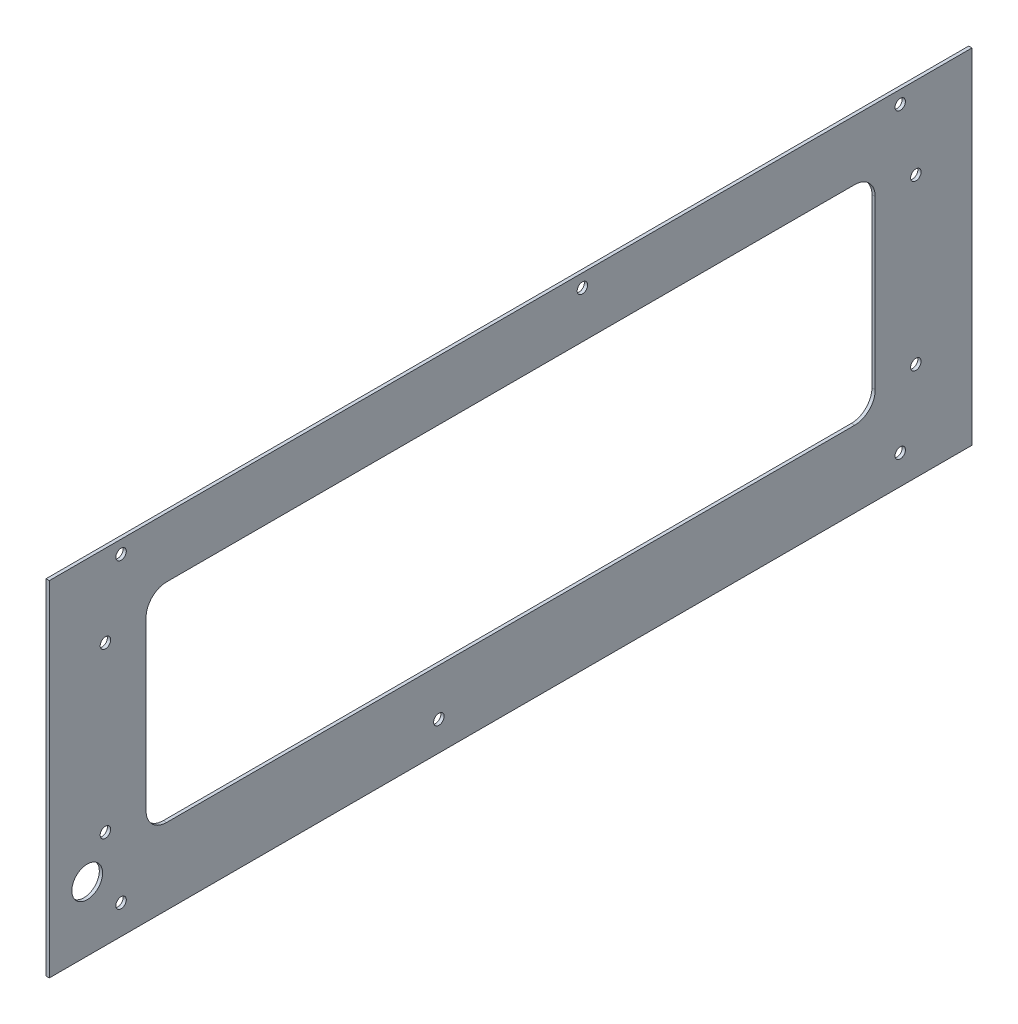
ISO-10303-21;
HEADER;
FILE_DESCRIPTION(('STEP AP214'),'2;1');
FILE_NAME('part.step','',(''),(''),'','','');
FILE_SCHEMA(('AUTOMOTIVE_DESIGN { 1 0 10303 214 1 1 1 1 }'));
ENDSEC;
DATA;
#1=APPLICATION_CONTEXT('core data for automotive mechanical design processes');
#2=APPLICATION_PROTOCOL_DEFINITION('international standard','automotive_design',2000,#1);
#3=PRODUCT_CONTEXT('',#1,'mechanical');
#4=PRODUCT('Part','Part','',(#3));
#5=PRODUCT_RELATED_PRODUCT_CATEGORY('part','',(#4));
#6=PRODUCT_DEFINITION_FORMATION('','',#4);
#7=PRODUCT_DEFINITION_CONTEXT('part definition',#1,'design');
#8=PRODUCT_DEFINITION('design','',#6,#7);
#9=PRODUCT_DEFINITION_SHAPE('','',#8);
#10=(LENGTH_UNIT() NAMED_UNIT(*) SI_UNIT(.MILLI.,.METRE.));
#11=(NAMED_UNIT(*) PLANE_ANGLE_UNIT() SI_UNIT($,.RADIAN.));
#12=(NAMED_UNIT(*) SI_UNIT($,.STERADIAN.) SOLID_ANGLE_UNIT());
#13=UNCERTAINTY_MEASURE_WITH_UNIT(LENGTH_MEASURE(1.E-05),#10,'distance_accuracy_value','');
#14=(GEOMETRIC_REPRESENTATION_CONTEXT(3) GLOBAL_UNCERTAINTY_ASSIGNED_CONTEXT((#13)) GLOBAL_UNIT_ASSIGNED_CONTEXT((#10,
#11,#12)) REPRESENTATION_CONTEXT('',''));
#15=CARTESIAN_POINT('',(0.,0.,0.));
#16=DIRECTION('',(0.,0.,1.));
#17=DIRECTION('',(1.,0.,0.));
#18=AXIS2_PLACEMENT_3D('',#15,#16,#17);
#19=CARTESIAN_POINT('',(1.6002,79.95380835,225.));
#20=DIRECTION('',(0.,0.,-1.));
#21=DIRECTION('',(0.,1.,0.));
#22=AXIS2_PLACEMENT_3D('',#19,#20,#21);
#23=PLANE('',#22);
#24=DIRECTION('',(0.,-1.,0.));
#25=VECTOR('',#24,1.);
#26=CARTESIAN_POINT('',(0.,79.95380835,225.));
#27=LINE('',#26,#25);
#28=CARTESIAN_POINT('',(0.,79.95380835,225.));
#29=VERTEX_POINT('',#28);
#30=CARTESIAN_POINT('',(0.,-87.87860835,225.));
#31=VERTEX_POINT('',#30);
#32=EDGE_CURVE('E145',#29,#31,#27,.T.);
#33=ORIENTED_EDGE('',*,*,#32,.T.);
#34=DIRECTION('',(-1.,0.,0.));
#35=VECTOR('',#34,1.);
#36=CARTESIAN_POINT('',(1.6002,-87.87860835,225.));
#37=LINE('',#36,#35);
#38=CARTESIAN_POINT('',(1.6002,-87.87860835,225.));
#39=VERTEX_POINT('',#38);
#40=EDGE_CURVE('E126',#39,#31,#37,.T.);
#41=ORIENTED_EDGE('',*,*,#40,.F.);
#42=DIRECTION('',(0.,-1.,0.));
#43=VECTOR('',#42,1.);
#44=CARTESIAN_POINT('',(1.6002,79.95380835,225.));
#45=LINE('',#44,#43);
#46=CARTESIAN_POINT('',(1.6002,79.95380835,225.));
#47=VERTEX_POINT('',#46);
#48=EDGE_CURVE('E133',#47,#39,#45,.T.);
#49=ORIENTED_EDGE('',*,*,#48,.F.);
#50=DIRECTION('',(-1.,0.,0.));
#51=VECTOR('',#50,1.);
#52=CARTESIAN_POINT('',(1.6002,79.95380835,225.));
#53=LINE('',#52,#51);
#54=EDGE_CURVE('E265',#47,#29,#53,.T.);
#55=ORIENTED_EDGE('',*,*,#54,.T.);
#56=EDGE_LOOP('',(#33,#41,#49,#55));
#57=FACE_BOUND('',#56,.T.);
#58=ADVANCED_FACE('F32',(#57),#23,.F.);
#59=CARTESIAN_POINT('',(1.6002,-87.87860835,225.));
#60=DIRECTION('',(0.,1.,0.));
#61=DIRECTION('',(0.,0.,1.));
#62=AXIS2_PLACEMENT_3D('',#59,#60,#61);
#63=PLANE('',#62);
#64=DIRECTION('',(0.,0.,-1.));
#65=VECTOR('',#64,1.);
#66=CARTESIAN_POINT('',(0.,-87.87860835,225.));
#67=LINE('',#66,#65);
#68=CARTESIAN_POINT('',(0.,-87.87860835,-225.));
#69=VERTEX_POINT('',#68);
#70=EDGE_CURVE('E267',#31,#69,#67,.T.);
#71=ORIENTED_EDGE('',*,*,#70,.T.);
#72=DIRECTION('',(-1.,0.,0.));
#73=VECTOR('',#72,1.);
#74=CARTESIAN_POINT('',(1.6002,-87.87860835,-225.));
#75=LINE('',#74,#73);
#76=CARTESIAN_POINT('',(1.6002,-87.87860835,-225.));
#77=VERTEX_POINT('',#76);
#78=EDGE_CURVE('E129',#77,#69,#75,.T.);
#79=ORIENTED_EDGE('',*,*,#78,.F.);
#80=DIRECTION('',(0.,0.,-1.));
#81=VECTOR('',#80,1.);
#82=CARTESIAN_POINT('',(1.6002,-87.87860835,225.));
#83=LINE('',#82,#81);
#84=EDGE_CURVE('E122',#39,#77,#83,.T.);
#85=ORIENTED_EDGE('',*,*,#84,.F.);
#86=ORIENTED_EDGE('',*,*,#40,.T.);
#87=EDGE_LOOP('',(#71,#79,#85,#86));
#88=FACE_BOUND('',#87,.T.);
#89=ADVANCED_FACE('F124',(#88),#63,.F.);
#90=CARTESIAN_POINT('',(1.6002,79.95380835,-225.));
#91=DIRECTION('',(0.,0.,1.));
#92=DIRECTION('',(0.,-1.,0.));
#93=AXIS2_PLACEMENT_3D('',#90,#91,#92);
#94=PLANE('',#93);
#95=DIRECTION('',(0.,1.,0.));
#96=VECTOR('',#95,1.);
#97=CARTESIAN_POINT('',(0.,79.95380835,-225.));
#98=LINE('',#97,#96);
#99=CARTESIAN_POINT('',(0.,79.95380835,-225.));
#100=VERTEX_POINT('',#99);
#101=EDGE_CURVE('E269',#69,#100,#98,.T.);
#102=ORIENTED_EDGE('',*,*,#101,.T.);
#103=DIRECTION('',(-1.,0.,0.));
#104=VECTOR('',#103,1.);
#105=CARTESIAN_POINT('',(1.6002,79.95380835,-225.));
#106=LINE('',#105,#104);
#107=CARTESIAN_POINT('',(1.6002,79.95380835,-225.));
#108=VERTEX_POINT('',#107);
#109=EDGE_CURVE('E150',#108,#100,#106,.T.);
#110=ORIENTED_EDGE('',*,*,#109,.F.);
#111=DIRECTION('',(0.,1.,0.));
#112=VECTOR('',#111,1.);
#113=CARTESIAN_POINT('',(1.6002,79.95380835,-225.));
#114=LINE('',#113,#112);
#115=EDGE_CURVE('E132',#77,#108,#114,.T.);
#116=ORIENTED_EDGE('',*,*,#115,.F.);
#117=ORIENTED_EDGE('',*,*,#78,.T.);
#118=EDGE_LOOP('',(#102,#110,#116,#117));
#119=FACE_BOUND('',#118,.T.);
#120=ADVANCED_FACE('F280',(#119),#94,.F.);
#121=CARTESIAN_POINT('',(1.6002,79.95380835,225.));
#122=DIRECTION('',(0.,-1.,0.));
#123=DIRECTION('',(0.,0.,-1.));
#124=AXIS2_PLACEMENT_3D('',#121,#122,#123);
#125=PLANE('',#124);
#126=DIRECTION('',(0.,0.,1.));
#127=VECTOR('',#126,1.);
#128=CARTESIAN_POINT('',(0.,79.95380835,225.));
#129=LINE('',#128,#127);
#130=EDGE_CURVE('E142',#100,#29,#129,.T.);
#131=ORIENTED_EDGE('',*,*,#130,.T.);
#132=ORIENTED_EDGE('',*,*,#54,.F.);
#133=DIRECTION('',(0.,0.,1.));
#134=VECTOR('',#133,1.);
#135=CARTESIAN_POINT('',(1.6002,79.95380835,225.));
#136=LINE('',#135,#134);
#137=EDGE_CURVE('E138',#108,#47,#136,.T.);
#138=ORIENTED_EDGE('',*,*,#137,.F.);
#139=ORIENTED_EDGE('',*,*,#109,.T.);
#140=EDGE_LOOP('',(#131,#132,#138,#139));
#141=FACE_BOUND('',#140,.T.);
#142=ADVANCED_FACE('F276',(#141),#125,.F.);
#143=CARTESIAN_POINT('',(1.6002,0.,0.));
#144=DIRECTION('',(1.,0.,0.));
#145=DIRECTION('',(0.,0.,-1.));
#146=AXIS2_PLACEMENT_3D('',#143,#144,#145);
#147=PLANE('',#146);
#148=CARTESIAN_POINT('',(1.6002,40.,197.627));
#149=DIRECTION('',(1.,0.,0.));
#150=DIRECTION('',(0.,0.,-1.));
#151=AXIS2_PLACEMENT_3D('',#148,#149,#150);
#152=CIRCLE('',#151,2.55269999999998);
#153=CARTESIAN_POINT('',(1.6002,40.,195.0743));
#154=VERTEX_POINT('',#153);
#155=EDGE_CURVE('E395',#154,#154,#152,.T.);
#156=ORIENTED_EDGE('',*,*,#155,.F.);
#157=EDGE_LOOP('',(#156));
#158=FACE_BOUND('',#157,.T.);
#159=CARTESIAN_POINT('',(1.6002,-40.,197.627));
#160=DIRECTION('',(1.,0.,0.));
#161=DIRECTION('',(0.,0.,-1.));
#162=AXIS2_PLACEMENT_3D('',#159,#160,#161);
#163=CIRCLE('',#162,2.55269999999998);
#164=CARTESIAN_POINT('',(1.6002,-40.,195.0743));
#165=VERTEX_POINT('',#164);
#166=EDGE_CURVE('E391',#165,#165,#163,.T.);
#167=ORIENTED_EDGE('',*,*,#166,.F.);
#168=EDGE_LOOP('',(#167));
#169=FACE_BOUND('',#168,.T.);
#170=CARTESIAN_POINT('',(1.6002,-40.,-197.627));
#171=DIRECTION('',(1.,0.,0.));
#172=DIRECTION('',(0.,0.,-1.));
#173=AXIS2_PLACEMENT_3D('',#170,#171,#172);
#174=CIRCLE('',#173,2.55269999999998);
#175=CARTESIAN_POINT('',(1.6002,-40.,-200.1797));
#176=VERTEX_POINT('',#175);
#177=EDGE_CURVE('E385',#176,#176,#174,.T.);
#178=ORIENTED_EDGE('',*,*,#177,.F.);
#179=EDGE_LOOP('',(#178));
#180=FACE_BOUND('',#179,.T.);
#181=CARTESIAN_POINT('',(1.6002,40.,-197.627));
#182=DIRECTION('',(1.,0.,0.));
#183=DIRECTION('',(0.,0.,-1.));
#184=AXIS2_PLACEMENT_3D('',#181,#182,#183);
#185=CIRCLE('',#184,2.55269999999998);
#186=CARTESIAN_POINT('',(1.6002,40.,-200.1797));
#187=VERTEX_POINT('',#186);
#188=EDGE_CURVE('E381',#187,#187,#185,.T.);
#189=ORIENTED_EDGE('',*,*,#188,.F.);
#190=EDGE_LOOP('',(#189));
#191=FACE_BOUND('',#190,.T.);
#192=DIRECTION('',(0.,-1.,0.));
#193=VECTOR('',#192,1.);
#194=CARTESIAN_POINT('',(1.6002,50.8,177.8));
#195=LINE('',#194,#193);
#196=CARTESIAN_POINT('',(1.6002,40.8,177.8));
#197=VERTEX_POINT('',#196);
#198=CARTESIAN_POINT('',(1.6002,-40.8,177.8));
#199=VERTEX_POINT('',#198);
#200=EDGE_CURVE('E207',#197,#199,#195,.T.);
#201=ORIENTED_EDGE('',*,*,#200,.F.);
#202=CARTESIAN_POINT('',(1.6002,40.8,167.8));
#203=DIRECTION('',(1.,0.,0.));
#204=DIRECTION('',(0.,0.,-1.));
#205=AXIS2_PLACEMENT_3D('',#202,#203,#204);
#206=CIRCLE('',#205,10.);
#207=CARTESIAN_POINT('',(1.6002,50.8,167.8));
#208=VERTEX_POINT('',#207);
#209=EDGE_CURVE('E40',#197,#208,#206,.F.);
#210=ORIENTED_EDGE('',*,*,#209,.T.);
#211=DIRECTION('',(0.,0.,1.));
#212=VECTOR('',#211,1.);
#213=CARTESIAN_POINT('',(1.6002,50.8,177.8));
#214=LINE('',#213,#212);
#215=CARTESIAN_POINT('',(1.6002,50.8,-167.8));
#216=VERTEX_POINT('',#215);
#217=EDGE_CURVE('E205',#216,#208,#214,.T.);
#218=ORIENTED_EDGE('',*,*,#217,.F.);
#219=CARTESIAN_POINT('',(1.6002,40.8,-167.8));
#220=DIRECTION('',(1.,0.,0.));
#221=DIRECTION('',(0.,0.,-1.));
#222=AXIS2_PLACEMENT_3D('',#219,#220,#221);
#223=CIRCLE('',#222,10.);
#224=CARTESIAN_POINT('',(1.6002,40.8,-177.8));
#225=VERTEX_POINT('',#224);
#226=EDGE_CURVE('E199',#216,#225,#223,.F.);
#227=ORIENTED_EDGE('',*,*,#226,.T.);
#228=DIRECTION('',(0.,1.,0.));
#229=VECTOR('',#228,1.);
#230=CARTESIAN_POINT('',(1.6002,50.8,-177.8));
#231=LINE('',#230,#229);
#232=CARTESIAN_POINT('',(1.6002,-40.8,-177.8));
#233=VERTEX_POINT('',#232);
#234=EDGE_CURVE('E213',#233,#225,#231,.T.);
#235=ORIENTED_EDGE('',*,*,#234,.F.);
#236=CARTESIAN_POINT('',(1.6002,-40.8,-167.8));
#237=DIRECTION('',(1.,0.,0.));
#238=DIRECTION('',(0.,0.,-1.));
#239=AXIS2_PLACEMENT_3D('',#236,#237,#238);
#240=CIRCLE('',#239,10.);
#241=CARTESIAN_POINT('',(1.6002,-50.8,-167.8));
#242=VERTEX_POINT('',#241);
#243=EDGE_CURVE('E195',#233,#242,#240,.F.);
#244=ORIENTED_EDGE('',*,*,#243,.T.);
#245=DIRECTION('',(0.,0.,-1.));
#246=VECTOR('',#245,1.);
#247=CARTESIAN_POINT('',(1.6002,-50.8,177.8));
#248=LINE('',#247,#246);
#249=CARTESIAN_POINT('',(1.6002,-50.8,167.8));
#250=VERTEX_POINT('',#249);
#251=EDGE_CURVE('E238',#250,#242,#248,.T.);
#252=ORIENTED_EDGE('',*,*,#251,.F.);
#253=CARTESIAN_POINT('',(1.6002,-40.8,167.8));
#254=DIRECTION('',(1.,0.,0.));
#255=DIRECTION('',(0.,0.,-1.));
#256=AXIS2_PLACEMENT_3D('',#253,#254,#255);
#257=CIRCLE('',#256,10.);
#258=EDGE_CURVE('E191',#250,#199,#257,.F.);
#259=ORIENTED_EDGE('',*,*,#258,.T.);
#260=EDGE_LOOP('',(#201,#210,#218,#227,#235,#244,#252,#259));
#261=FACE_BOUND('',#260,.T.);
#262=CARTESIAN_POINT('',(1.6002,-56.5321,206.5));
#263=DIRECTION('',(1.,0.,0.));
#264=DIRECTION('',(0.,0.,-1.));
#265=AXIS2_PLACEMENT_3D('',#262,#263,#264);
#266=CIRCLE('',#265,7.50000000000001);
#267=CARTESIAN_POINT('',(1.6002,-56.5321,199.));
#268=VERTEX_POINT('',#267);
#269=EDGE_CURVE('E236',#268,#268,#266,.T.);
#270=ORIENTED_EDGE('',*,*,#269,.F.);
#271=EDGE_LOOP('',(#270));
#272=FACE_BOUND('',#271,.T.);
#273=CARTESIAN_POINT('',(1.6002,73.59110835,190.));
#274=DIRECTION('',(1.,0.,0.));
#275=DIRECTION('',(0.,0.,-1.));
#276=AXIS2_PLACEMENT_3D('',#273,#274,#275);
#277=CIRCLE('',#276,2.55269999999999);
#278=CARTESIAN_POINT('',(1.6002,73.59110835,187.4473));
#279=VERTEX_POINT('',#278);
#280=EDGE_CURVE('E173',#279,#279,#277,.T.);
#281=ORIENTED_EDGE('',*,*,#280,.F.);
#282=EDGE_LOOP('',(#281));
#283=FACE_BOUND('',#282,.T.);
#284=CARTESIAN_POINT('',(1.6002,73.59110835,-35.));
#285=DIRECTION('',(1.,0.,0.));
#286=DIRECTION('',(0.,0.,-1.));
#287=AXIS2_PLACEMENT_3D('',#284,#285,#286);
#288=CIRCLE('',#287,2.55269999999999);
#289=CARTESIAN_POINT('',(1.6002,73.59110835,-37.5527));
#290=VERTEX_POINT('',#289);
#291=EDGE_CURVE('E170',#290,#290,#288,.T.);
#292=ORIENTED_EDGE('',*,*,#291,.F.);
#293=EDGE_LOOP('',(#292));
#294=FACE_BOUND('',#293,.T.);
#295=CARTESIAN_POINT('',(1.6002,-73.59110835,35.));
#296=DIRECTION('',(1.,0.,0.));
#297=DIRECTION('',(0.,0.,-1.));
#298=AXIS2_PLACEMENT_3D('',#295,#296,#297);
#299=CIRCLE('',#298,2.55269999999999);
#300=CARTESIAN_POINT('',(1.6002,-73.59110835,32.4473));
#301=VERTEX_POINT('',#300);
#302=EDGE_CURVE('E166',#301,#301,#299,.T.);
#303=ORIENTED_EDGE('',*,*,#302,.F.);
#304=EDGE_LOOP('',(#303));
#305=FACE_BOUND('',#304,.T.);
#306=CARTESIAN_POINT('',(1.6002,-73.59110835,190.));
#307=DIRECTION('',(1.,0.,0.));
#308=DIRECTION('',(0.,0.,-1.));
#309=AXIS2_PLACEMENT_3D('',#306,#307,#308);
#310=CIRCLE('',#309,2.55269999999999);
#311=CARTESIAN_POINT('',(1.6002,-73.59110835,187.4473));
#312=VERTEX_POINT('',#311);
#313=EDGE_CURVE('E162',#312,#312,#310,.T.);
#314=ORIENTED_EDGE('',*,*,#313,.F.);
#315=EDGE_LOOP('',(#314));
#316=FACE_BOUND('',#315,.T.);
#317=CARTESIAN_POINT('',(1.6002,73.59110835,-190.));
#318=DIRECTION('',(1.,0.,0.));
#319=DIRECTION('',(0.,0.,-1.));
#320=AXIS2_PLACEMENT_3D('',#317,#318,#319);
#321=CIRCLE('',#320,2.55269999999999);
#322=CARTESIAN_POINT('',(1.6002,73.59110835,-192.5527));
#323=VERTEX_POINT('',#322);
#324=EDGE_CURVE('E158',#323,#323,#321,.T.);
#325=ORIENTED_EDGE('',*,*,#324,.F.);
#326=EDGE_LOOP('',(#325));
#327=FACE_BOUND('',#326,.T.);
#328=CARTESIAN_POINT('',(1.6002,-73.59110835,-190.));
#329=DIRECTION('',(1.,0.,0.));
#330=DIRECTION('',(0.,0.,-1.));
#331=AXIS2_PLACEMENT_3D('',#328,#329,#330);
#332=CIRCLE('',#331,2.55269999999999);
#333=CARTESIAN_POINT('',(1.6002,-73.59110835,-192.5527));
#334=VERTEX_POINT('',#333);
#335=EDGE_CURVE('E157',#334,#334,#332,.T.);
#336=ORIENTED_EDGE('',*,*,#335,.F.);
#337=EDGE_LOOP('',(#336));
#338=FACE_BOUND('',#337,.T.);
#339=ORIENTED_EDGE('',*,*,#48,.T.);
#340=ORIENTED_EDGE('',*,*,#84,.T.);
#341=ORIENTED_EDGE('',*,*,#115,.T.);
#342=ORIENTED_EDGE('',*,*,#137,.T.);
#343=EDGE_LOOP('',(#339,#340,#341,#342));
#344=FACE_BOUND('',#343,.T.);
#345=ADVANCED_FACE('F136',(#158,#169,#180,#191,#261,#272,#283,#294,#305,#316,#327,#338,#344),
#147,.T.);
#346=CARTESIAN_POINT('',(0.,0.,0.));
#347=DIRECTION('',(1.,0.,0.));
#348=DIRECTION('',(0.,0.,-1.));
#349=AXIS2_PLACEMENT_3D('',#346,#347,#348);
#350=PLANE('',#349);
#351=CARTESIAN_POINT('',(0.,40.,197.627));
#352=DIRECTION('',(1.,0.,0.));
#353=DIRECTION('',(0.,0.,-1.));
#354=AXIS2_PLACEMENT_3D('',#351,#352,#353);
#355=CIRCLE('',#354,2.5527);
#356=CARTESIAN_POINT('',(0.,40.,195.0743));
#357=VERTEX_POINT('',#356);
#358=EDGE_CURVE('E369',#357,#357,#355,.T.);
#359=ORIENTED_EDGE('',*,*,#358,.T.);
#360=EDGE_LOOP('',(#359));
#361=FACE_BOUND('',#360,.T.);
#362=CARTESIAN_POINT('',(0.,-40.,197.627));
#363=DIRECTION('',(1.,0.,0.));
#364=DIRECTION('',(0.,0.,-1.));
#365=AXIS2_PLACEMENT_3D('',#362,#363,#364);
#366=CIRCLE('',#365,2.5527);
#367=CARTESIAN_POINT('',(0.,-40.,195.0743));
#368=VERTEX_POINT('',#367);
#369=EDGE_CURVE('E373',#368,#368,#366,.T.);
#370=ORIENTED_EDGE('',*,*,#369,.T.);
#371=EDGE_LOOP('',(#370));
#372=FACE_BOUND('',#371,.T.);
#373=CARTESIAN_POINT('',(0.,-40.,-197.627));
#374=DIRECTION('',(1.,0.,0.));
#375=DIRECTION('',(0.,0.,-1.));
#376=AXIS2_PLACEMENT_3D('',#373,#374,#375);
#377=CIRCLE('',#376,2.5527);
#378=CARTESIAN_POINT('',(0.,-40.,-200.1797));
#379=VERTEX_POINT('',#378);
#380=EDGE_CURVE('E377',#379,#379,#377,.T.);
#381=ORIENTED_EDGE('',*,*,#380,.T.);
#382=EDGE_LOOP('',(#381));
#383=FACE_BOUND('',#382,.T.);
#384=CARTESIAN_POINT('',(0.,40.,-197.627));
#385=DIRECTION('',(1.,0.,0.));
#386=DIRECTION('',(0.,0.,-1.));
#387=AXIS2_PLACEMENT_3D('',#384,#385,#386);
#388=CIRCLE('',#387,2.5527);
#389=CARTESIAN_POINT('',(0.,40.,-200.1797));
#390=VERTEX_POINT('',#389);
#391=EDGE_CURVE('E231',#390,#390,#388,.T.);
#392=ORIENTED_EDGE('',*,*,#391,.T.);
#393=EDGE_LOOP('',(#392));
#394=FACE_BOUND('',#393,.T.);
#395=DIRECTION('',(0.,1.,0.));
#396=VECTOR('',#395,1.);
#397=CARTESIAN_POINT('',(0.,50.8,-177.8));
#398=LINE('',#397,#396);
#399=CARTESIAN_POINT('',(0.,-40.8,-177.8));
#400=VERTEX_POINT('',#399);
#401=CARTESIAN_POINT('',(0.,40.8,-177.8));
#402=VERTEX_POINT('',#401);
#403=EDGE_CURVE('E228',#400,#402,#398,.T.);
#404=ORIENTED_EDGE('',*,*,#403,.T.);
#405=CARTESIAN_POINT('',(0.,40.8,-167.8));
#406=DIRECTION('',(1.,0.,0.));
#407=DIRECTION('',(0.,0.,-1.));
#408=AXIS2_PLACEMENT_3D('',#405,#406,#407);
#409=CIRCLE('',#408,10.);
#410=CARTESIAN_POINT('',(0.,50.8,-167.8));
#411=VERTEX_POINT('',#410);
#412=EDGE_CURVE('E54',#402,#411,#409,.T.);
#413=ORIENTED_EDGE('',*,*,#412,.T.);
#414=DIRECTION('',(0.,0.,1.));
#415=VECTOR('',#414,1.);
#416=CARTESIAN_POINT('',(0.,50.8,177.8));
#417=LINE('',#416,#415);
#418=CARTESIAN_POINT('',(0.,50.8,167.8));
#419=VERTEX_POINT('',#418);
#420=EDGE_CURVE('E221',#411,#419,#417,.T.);
#421=ORIENTED_EDGE('',*,*,#420,.T.);
#422=CARTESIAN_POINT('',(0.,40.8,167.8));
#423=DIRECTION('',(1.,0.,0.));
#424=DIRECTION('',(0.,0.,-1.));
#425=AXIS2_PLACEMENT_3D('',#422,#423,#424);
#426=CIRCLE('',#425,10.);
#427=CARTESIAN_POINT('',(0.,40.8,177.8));
#428=VERTEX_POINT('',#427);
#429=EDGE_CURVE('E11',#419,#428,#426,.T.);
#430=ORIENTED_EDGE('',*,*,#429,.T.);
#431=DIRECTION('',(0.,-1.,0.));
#432=VECTOR('',#431,1.);
#433=CARTESIAN_POINT('',(0.,50.8,177.8));
#434=LINE('',#433,#432);
#435=CARTESIAN_POINT('',(0.,-40.8,177.8));
#436=VERTEX_POINT('',#435);
#437=EDGE_CURVE('E212',#428,#436,#434,.T.);
#438=ORIENTED_EDGE('',*,*,#437,.T.);
#439=CARTESIAN_POINT('',(0.,-40.8,167.8));
#440=DIRECTION('',(1.,0.,0.));
#441=DIRECTION('',(0.,0.,-1.));
#442=AXIS2_PLACEMENT_3D('',#439,#440,#441);
#443=CIRCLE('',#442,10.);
#444=CARTESIAN_POINT('',(0.,-50.8,167.8));
#445=VERTEX_POINT('',#444);
#446=EDGE_CURVE('E193',#436,#445,#443,.T.);
#447=ORIENTED_EDGE('',*,*,#446,.T.);
#448=DIRECTION('',(0.,0.,-1.));
#449=VECTOR('',#448,1.);
#450=CARTESIAN_POINT('',(0.,-50.8,177.8));
#451=LINE('',#450,#449);
#452=CARTESIAN_POINT('',(0.,-50.8,-167.8));
#453=VERTEX_POINT('',#452);
#454=EDGE_CURVE('E225',#445,#453,#451,.T.);
#455=ORIENTED_EDGE('',*,*,#454,.T.);
#456=CARTESIAN_POINT('',(0.,-40.8,-167.8));
#457=DIRECTION('',(1.,0.,0.));
#458=DIRECTION('',(0.,0.,-1.));
#459=AXIS2_PLACEMENT_3D('',#456,#457,#458);
#460=CIRCLE('',#459,10.);
#461=EDGE_CURVE('E197',#453,#400,#460,.T.);
#462=ORIENTED_EDGE('',*,*,#461,.T.);
#463=EDGE_LOOP('',(#404,#413,#421,#430,#438,#447,#455,#462));
#464=FACE_BOUND('',#463,.T.);
#465=CARTESIAN_POINT('',(0.,-56.5321,206.5));
#466=DIRECTION('',(1.,0.,0.));
#467=DIRECTION('',(0.,0.,-1.));
#468=AXIS2_PLACEMENT_3D('',#465,#466,#467);
#469=CIRCLE('',#468,7.50000000000001);
#470=CARTESIAN_POINT('',(0.,-56.5321,199.));
#471=VERTEX_POINT('',#470);
#472=EDGE_CURVE('E243',#471,#471,#469,.T.);
#473=ORIENTED_EDGE('',*,*,#472,.T.);
#474=EDGE_LOOP('',(#473));
#475=FACE_BOUND('',#474,.T.);
#476=CARTESIAN_POINT('',(0.,73.59110835,190.));
#477=DIRECTION('',(1.,0.,0.));
#478=DIRECTION('',(0.,0.,-1.));
#479=AXIS2_PLACEMENT_3D('',#476,#477,#478);
#480=CIRCLE('',#479,2.55269999999998);
#481=CARTESIAN_POINT('',(0.,73.59110835,187.4473));
#482=VERTEX_POINT('',#481);
#483=EDGE_CURVE('E171',#482,#482,#480,.T.);
#484=ORIENTED_EDGE('',*,*,#483,.T.);
#485=EDGE_LOOP('',(#484));
#486=FACE_BOUND('',#485,.T.);
#487=CARTESIAN_POINT('',(0.,73.59110835,-35.));
#488=DIRECTION('',(1.,0.,0.));
#489=DIRECTION('',(0.,0.,-1.));
#490=AXIS2_PLACEMENT_3D('',#487,#488,#489);
#491=CIRCLE('',#490,2.55269999999998);
#492=CARTESIAN_POINT('',(0.,73.59110835,-37.5526999999999));
#493=VERTEX_POINT('',#492);
#494=EDGE_CURVE('E167',#493,#493,#491,.T.);
#495=ORIENTED_EDGE('',*,*,#494,.T.);
#496=EDGE_LOOP('',(#495));
#497=FACE_BOUND('',#496,.T.);
#498=CARTESIAN_POINT('',(0.,-73.59110835,35.));
#499=DIRECTION('',(1.,0.,0.));
#500=DIRECTION('',(0.,0.,-1.));
#501=AXIS2_PLACEMENT_3D('',#498,#499,#500);
#502=CIRCLE('',#501,2.55269999999998);
#503=CARTESIAN_POINT('',(0.,-73.59110835,32.4473));
#504=VERTEX_POINT('',#503);
#505=EDGE_CURVE('E163',#504,#504,#502,.T.);
#506=ORIENTED_EDGE('',*,*,#505,.T.);
#507=EDGE_LOOP('',(#506));
#508=FACE_BOUND('',#507,.T.);
#509=CARTESIAN_POINT('',(0.,-73.59110835,190.));
#510=DIRECTION('',(1.,0.,0.));
#511=DIRECTION('',(0.,0.,-1.));
#512=AXIS2_PLACEMENT_3D('',#509,#510,#511);
#513=CIRCLE('',#512,2.55269999999998);
#514=CARTESIAN_POINT('',(0.,-73.59110835,187.4473));
#515=VERTEX_POINT('',#514);
#516=EDGE_CURVE('E159',#515,#515,#513,.T.);
#517=ORIENTED_EDGE('',*,*,#516,.T.);
#518=EDGE_LOOP('',(#517));
#519=FACE_BOUND('',#518,.T.);
#520=CARTESIAN_POINT('',(0.,73.59110835,-190.));
#521=DIRECTION('',(1.,0.,0.));
#522=DIRECTION('',(0.,0.,-1.));
#523=AXIS2_PLACEMENT_3D('',#520,#521,#522);
#524=CIRCLE('',#523,2.55269999999998);
#525=CARTESIAN_POINT('',(0.,73.59110835,-192.5527));
#526=VERTEX_POINT('',#525);
#527=EDGE_CURVE('E154',#526,#526,#524,.T.);
#528=ORIENTED_EDGE('',*,*,#527,.T.);
#529=EDGE_LOOP('',(#528));
#530=FACE_BOUND('',#529,.T.);
#531=CARTESIAN_POINT('',(0.,-73.59110835,-190.));
#532=DIRECTION('',(1.,0.,0.));
#533=DIRECTION('',(0.,0.,-1.));
#534=AXIS2_PLACEMENT_3D('',#531,#532,#533);
#535=CIRCLE('',#534,2.55269999999998);
#536=CARTESIAN_POINT('',(0.,-73.59110835,-192.5527));
#537=VERTEX_POINT('',#536);
#538=EDGE_CURVE('E260',#537,#537,#535,.T.);
#539=ORIENTED_EDGE('',*,*,#538,.T.);
#540=EDGE_LOOP('',(#539));
#541=FACE_BOUND('',#540,.T.);
#542=ORIENTED_EDGE('',*,*,#32,.F.);
#543=ORIENTED_EDGE('',*,*,#130,.F.);
#544=ORIENTED_EDGE('',*,*,#101,.F.);
#545=ORIENTED_EDGE('',*,*,#70,.F.);
#546=EDGE_LOOP('',(#542,#543,#544,#545));
#547=FACE_BOUND('',#546,.T.);
#548=ADVANCED_FACE('F218',(#361,#372,#383,#394,#464,#475,#486,#497,#508,#519,#530,#541,#547),
#350,.F.);
#549=CARTESIAN_POINT('',(1.6002,-73.59110835,-190.));
#550=DIRECTION('',(1.,0.,0.));
#551=DIRECTION('',(0.,0.,-1.));
#552=AXIS2_PLACEMENT_3D('',#549,#550,#551);
#553=CYLINDRICAL_SURFACE('',#552,2.55269999999998);
#554=ORIENTED_EDGE('',*,*,#335,.T.);
#555=EDGE_LOOP('',(#554));
#556=FACE_BOUND('',#555,.T.);
#557=ORIENTED_EDGE('',*,*,#538,.F.);
#558=EDGE_LOOP('',(#557));
#559=FACE_BOUND('',#558,.T.);
#560=ADVANCED_FACE('F354',(#556,#559),#553,.F.);
#561=CARTESIAN_POINT('',(1.6002,73.59110835,-190.));
#562=DIRECTION('',(1.,0.,0.));
#563=DIRECTION('',(0.,0.,-1.));
#564=AXIS2_PLACEMENT_3D('',#561,#562,#563);
#565=CYLINDRICAL_SURFACE('',#564,2.55269999999998);
#566=ORIENTED_EDGE('',*,*,#324,.T.);
#567=EDGE_LOOP('',(#566));
#568=FACE_BOUND('',#567,.T.);
#569=ORIENTED_EDGE('',*,*,#527,.F.);
#570=EDGE_LOOP('',(#569));
#571=FACE_BOUND('',#570,.T.);
#572=ADVANCED_FACE('F350',(#568,#571),#565,.F.);
#573=CARTESIAN_POINT('',(1.6002,-73.59110835,190.));
#574=DIRECTION('',(1.,0.,0.));
#575=DIRECTION('',(0.,0.,-1.));
#576=AXIS2_PLACEMENT_3D('',#573,#574,#575);
#577=CYLINDRICAL_SURFACE('',#576,2.55269999999998);
#578=ORIENTED_EDGE('',*,*,#313,.T.);
#579=EDGE_LOOP('',(#578));
#580=FACE_BOUND('',#579,.T.);
#581=ORIENTED_EDGE('',*,*,#516,.F.);
#582=EDGE_LOOP('',(#581));
#583=FACE_BOUND('',#582,.T.);
#584=ADVANCED_FACE('F346',(#580,#583),#577,.F.);
#585=CARTESIAN_POINT('',(1.6002,-73.59110835,35.));
#586=DIRECTION('',(1.,0.,0.));
#587=DIRECTION('',(0.,0.,-1.));
#588=AXIS2_PLACEMENT_3D('',#585,#586,#587);
#589=CYLINDRICAL_SURFACE('',#588,2.55269999999998);
#590=ORIENTED_EDGE('',*,*,#302,.T.);
#591=EDGE_LOOP('',(#590));
#592=FACE_BOUND('',#591,.T.);
#593=ORIENTED_EDGE('',*,*,#505,.F.);
#594=EDGE_LOOP('',(#593));
#595=FACE_BOUND('',#594,.T.);
#596=ADVANCED_FACE('F342',(#592,#595),#589,.F.);
#597=CARTESIAN_POINT('',(1.6002,73.59110835,-35.));
#598=DIRECTION('',(1.,0.,0.));
#599=DIRECTION('',(0.,0.,-1.));
#600=AXIS2_PLACEMENT_3D('',#597,#598,#599);
#601=CYLINDRICAL_SURFACE('',#600,2.55269999999998);
#602=ORIENTED_EDGE('',*,*,#291,.T.);
#603=EDGE_LOOP('',(#602));
#604=FACE_BOUND('',#603,.T.);
#605=ORIENTED_EDGE('',*,*,#494,.F.);
#606=EDGE_LOOP('',(#605));
#607=FACE_BOUND('',#606,.T.);
#608=ADVANCED_FACE('F338',(#604,#607),#601,.F.);
#609=CARTESIAN_POINT('',(1.6002,73.59110835,190.));
#610=DIRECTION('',(1.,0.,0.));
#611=DIRECTION('',(0.,0.,-1.));
#612=AXIS2_PLACEMENT_3D('',#609,#610,#611);
#613=CYLINDRICAL_SURFACE('',#612,2.55269999999998);
#614=ORIENTED_EDGE('',*,*,#280,.T.);
#615=EDGE_LOOP('',(#614));
#616=FACE_BOUND('',#615,.T.);
#617=ORIENTED_EDGE('',*,*,#483,.F.);
#618=EDGE_LOOP('',(#617));
#619=FACE_BOUND('',#618,.T.);
#620=ADVANCED_FACE('F334',(#616,#619),#613,.F.);
#621=CARTESIAN_POINT('',(0.,-56.5321,206.5));
#622=DIRECTION('',(1.,0.,0.));
#623=DIRECTION('',(0.,0.,-1.));
#624=AXIS2_PLACEMENT_3D('',#621,#622,#623);
#625=CYLINDRICAL_SURFACE('',#624,7.50000000000001);
#626=ORIENTED_EDGE('',*,*,#472,.F.);
#627=EDGE_LOOP('',(#626));
#628=FACE_BOUND('',#627,.T.);
#629=ORIENTED_EDGE('',*,*,#269,.T.);
#630=EDGE_LOOP('',(#629));
#631=FACE_BOUND('',#630,.T.);
#632=ADVANCED_FACE('F331',(#628,#631),#625,.F.);
#633=CARTESIAN_POINT('',(0.,50.8,177.8));
#634=DIRECTION('',(0.,0.,1.));
#635=DIRECTION('',(1.,0.,0.));
#636=AXIS2_PLACEMENT_3D('',#633,#634,#635);
#637=PLANE('',#636);
#638=ORIENTED_EDGE('',*,*,#200,.T.);
#639=DIRECTION('',(1.,0.,0.));
#640=VECTOR('',#639,1.);
#641=CARTESIAN_POINT('',(0.,-40.8,177.8));
#642=LINE('',#641,#640);
#643=EDGE_CURVE('E180',#199,#436,#642,.F.);
#644=ORIENTED_EDGE('',*,*,#643,.T.);
#645=ORIENTED_EDGE('',*,*,#437,.F.);
#646=DIRECTION('',(1.,0.,0.));
#647=VECTOR('',#646,1.);
#648=CARTESIAN_POINT('',(1.6002,40.8,177.8));
#649=LINE('',#648,#647);
#650=EDGE_CURVE('E177',#428,#197,#649,.T.);
#651=ORIENTED_EDGE('',*,*,#650,.T.);
#652=EDGE_LOOP('',(#638,#644,#645,#651));
#653=FACE_BOUND('',#652,.T.);
#654=ADVANCED_FACE('F223',(#653),#637,.F.);
#655=CARTESIAN_POINT('',(0.,50.8,177.8));
#656=DIRECTION('',(0.,1.,0.));
#657=DIRECTION('',(0.,0.,1.));
#658=AXIS2_PLACEMENT_3D('',#655,#656,#657);
#659=PLANE('',#658);
#660=ORIENTED_EDGE('',*,*,#420,.F.);
#661=DIRECTION('',(1.,0.,0.));
#662=VECTOR('',#661,1.);
#663=CARTESIAN_POINT('',(1.6002,50.8,-167.8));
#664=LINE('',#663,#662);
#665=EDGE_CURVE('E188',#411,#216,#664,.T.);
#666=ORIENTED_EDGE('',*,*,#665,.T.);
#667=ORIENTED_EDGE('',*,*,#217,.T.);
#668=DIRECTION('',(1.,0.,0.));
#669=VECTOR('',#668,1.);
#670=CARTESIAN_POINT('',(0.,50.8,167.8));
#671=LINE('',#670,#669);
#672=EDGE_CURVE('E47',#208,#419,#671,.F.);
#673=ORIENTED_EDGE('',*,*,#672,.T.);
#674=EDGE_LOOP('',(#660,#666,#667,#673));
#675=FACE_BOUND('',#674,.T.);
#676=ADVANCED_FACE('F210',(#675),#659,.F.);
#677=CARTESIAN_POINT('',(0.,50.8,-177.8));
#678=DIRECTION('',(0.,0.,-1.));
#679=DIRECTION('',(-1.,0.,0.));
#680=AXIS2_PLACEMENT_3D('',#677,#678,#679);
#681=PLANE('',#680);
#682=ORIENTED_EDGE('',*,*,#403,.F.);
#683=DIRECTION('',(1.,0.,0.));
#684=VECTOR('',#683,1.);
#685=CARTESIAN_POINT('',(1.6002,-40.8,-177.8));
#686=LINE('',#685,#684);
#687=EDGE_CURVE('E184',#400,#233,#686,.T.);
#688=ORIENTED_EDGE('',*,*,#687,.T.);
#689=ORIENTED_EDGE('',*,*,#234,.T.);
#690=DIRECTION('',(1.,0.,0.));
#691=VECTOR('',#690,1.);
#692=CARTESIAN_POINT('',(0.,40.8,-177.8));
#693=LINE('',#692,#691);
#694=EDGE_CURVE('E182',#225,#402,#693,.F.);
#695=ORIENTED_EDGE('',*,*,#694,.T.);
#696=EDGE_LOOP('',(#682,#688,#689,#695));
#697=FACE_BOUND('',#696,.T.);
#698=ADVANCED_FACE('F313',(#697),#681,.F.);
#699=CARTESIAN_POINT('',(0.,-50.8,177.8));
#700=DIRECTION('',(0.,-1.,0.));
#701=DIRECTION('',(0.,0.,-1.));
#702=AXIS2_PLACEMENT_3D('',#699,#700,#701);
#703=PLANE('',#702);
#704=ORIENTED_EDGE('',*,*,#454,.F.);
#705=DIRECTION('',(1.,0.,0.));
#706=VECTOR('',#705,1.);
#707=CARTESIAN_POINT('',(1.6002,-50.8,167.8));
#708=LINE('',#707,#706);
#709=EDGE_CURVE('E148',#445,#250,#708,.T.);
#710=ORIENTED_EDGE('',*,*,#709,.T.);
#711=ORIENTED_EDGE('',*,*,#251,.T.);
#712=DIRECTION('',(1.,0.,0.));
#713=VECTOR('',#712,1.);
#714=CARTESIAN_POINT('',(0.,-50.8,-167.8));
#715=LINE('',#714,#713);
#716=EDGE_CURVE('E146',#242,#453,#715,.F.);
#717=ORIENTED_EDGE('',*,*,#716,.T.);
#718=EDGE_LOOP('',(#704,#710,#711,#717));
#719=FACE_BOUND('',#718,.T.);
#720=ADVANCED_FACE('F298',(#719),#703,.F.);
#721=CARTESIAN_POINT('',(0.,-40.8,167.8));
#722=DIRECTION('',(-1.,0.,0.));
#723=DIRECTION('',(0.,0.,1.));
#724=AXIS2_PLACEMENT_3D('',#721,#722,#723);
#725=CYLINDRICAL_SURFACE('',#724,10.);
#726=ORIENTED_EDGE('',*,*,#446,.F.);
#727=ORIENTED_EDGE('',*,*,#643,.F.);
#728=ORIENTED_EDGE('',*,*,#258,.F.);
#729=ORIENTED_EDGE('',*,*,#709,.F.);
#730=EDGE_LOOP('',(#726,#727,#728,#729));
#731=FACE_BOUND('',#730,.T.);
#732=ADVANCED_FACE('F294',(#731),#725,.F.);
#733=CARTESIAN_POINT('',(0.,-40.8,-167.8));
#734=DIRECTION('',(-1.,0.,0.));
#735=DIRECTION('',(0.,0.,1.));
#736=AXIS2_PLACEMENT_3D('',#733,#734,#735);
#737=CYLINDRICAL_SURFACE('',#736,10.);
#738=ORIENTED_EDGE('',*,*,#461,.F.);
#739=ORIENTED_EDGE('',*,*,#716,.F.);
#740=ORIENTED_EDGE('',*,*,#243,.F.);
#741=ORIENTED_EDGE('',*,*,#687,.F.);
#742=EDGE_LOOP('',(#738,#739,#740,#741));
#743=FACE_BOUND('',#742,.T.);
#744=ADVANCED_FACE('F297',(#743),#737,.F.);
#745=CARTESIAN_POINT('',(0.,40.8,-167.8));
#746=DIRECTION('',(-1.,0.,0.));
#747=DIRECTION('',(0.,0.,1.));
#748=AXIS2_PLACEMENT_3D('',#745,#746,#747);
#749=CYLINDRICAL_SURFACE('',#748,10.);
#750=ORIENTED_EDGE('',*,*,#412,.F.);
#751=ORIENTED_EDGE('',*,*,#694,.F.);
#752=ORIENTED_EDGE('',*,*,#226,.F.);
#753=ORIENTED_EDGE('',*,*,#665,.F.);
#754=EDGE_LOOP('',(#750,#751,#752,#753));
#755=FACE_BOUND('',#754,.T.);
#756=ADVANCED_FACE('F301',(#755),#749,.F.);
#757=CARTESIAN_POINT('',(0.,40.8,167.8));
#758=DIRECTION('',(-1.,0.,0.));
#759=DIRECTION('',(0.,0.,1.));
#760=AXIS2_PLACEMENT_3D('',#757,#758,#759);
#761=CYLINDRICAL_SURFACE('',#760,10.);
#762=ORIENTED_EDGE('',*,*,#429,.F.);
#763=ORIENTED_EDGE('',*,*,#672,.F.);
#764=ORIENTED_EDGE('',*,*,#209,.F.);
#765=ORIENTED_EDGE('',*,*,#650,.F.);
#766=EDGE_LOOP('',(#762,#763,#764,#765));
#767=FACE_BOUND('',#766,.T.);
#768=ADVANCED_FACE('F34',(#767),#761,.F.);
#769=CARTESIAN_POINT('',(1.6002,40.,-197.627));
#770=DIRECTION('',(1.,0.,0.));
#771=DIRECTION('',(0.,0.,-1.));
#772=AXIS2_PLACEMENT_3D('',#769,#770,#771);
#773=CYLINDRICAL_SURFACE('',#772,2.55269999999999);
#774=ORIENTED_EDGE('',*,*,#391,.F.);
#775=EDGE_LOOP('',(#774));
#776=FACE_BOUND('',#775,.T.);
#777=ORIENTED_EDGE('',*,*,#188,.T.);
#778=EDGE_LOOP('',(#777));
#779=FACE_BOUND('',#778,.T.);
#780=ADVANCED_FACE('F308',(#776,#779),#773,.F.);
#781=CARTESIAN_POINT('',(1.6002,-40.,-197.627));
#782=DIRECTION('',(1.,0.,0.));
#783=DIRECTION('',(0.,0.,-1.));
#784=AXIS2_PLACEMENT_3D('',#781,#782,#783);
#785=CYLINDRICAL_SURFACE('',#784,2.55269999999999);
#786=ORIENTED_EDGE('',*,*,#380,.F.);
#787=EDGE_LOOP('',(#786));
#788=FACE_BOUND('',#787,.T.);
#789=ORIENTED_EDGE('',*,*,#177,.T.);
#790=EDGE_LOOP('',(#789));
#791=FACE_BOUND('',#790,.T.);
#792=ADVANCED_FACE('F406',(#788,#791),#785,.F.);
#793=CARTESIAN_POINT('',(1.6002,-40.,197.627));
#794=DIRECTION('',(1.,0.,0.));
#795=DIRECTION('',(0.,0.,-1.));
#796=AXIS2_PLACEMENT_3D('',#793,#794,#795);
#797=CYLINDRICAL_SURFACE('',#796,2.55269999999999);
#798=ORIENTED_EDGE('',*,*,#369,.F.);
#799=EDGE_LOOP('',(#798));
#800=FACE_BOUND('',#799,.T.);
#801=ORIENTED_EDGE('',*,*,#166,.T.);
#802=EDGE_LOOP('',(#801));
#803=FACE_BOUND('',#802,.T.);
#804=ADVANCED_FACE('F408',(#800,#803),#797,.F.);
#805=CARTESIAN_POINT('',(1.6002,40.,197.627));
#806=DIRECTION('',(1.,0.,0.));
#807=DIRECTION('',(0.,0.,-1.));
#808=AXIS2_PLACEMENT_3D('',#805,#806,#807);
#809=CYLINDRICAL_SURFACE('',#808,2.55269999999999);
#810=ORIENTED_EDGE('',*,*,#358,.F.);
#811=EDGE_LOOP('',(#810));
#812=FACE_BOUND('',#811,.T.);
#813=ORIENTED_EDGE('',*,*,#155,.T.);
#814=EDGE_LOOP('',(#813));
#815=FACE_BOUND('',#814,.T.);
#816=ADVANCED_FACE('F399',(#812,#815),#809,.F.);
#817=CLOSED_SHELL('',(#58,#89,#120,#142,#345,#548,#560,#572,#584,#596,#608,#620,#632,#654,#676,
#698,#720,#732,#744,#756,#768,#780,#792,#804,#816));
#818=MANIFOLD_SOLID_BREP('B2',#817);
#819=ADVANCED_BREP_SHAPE_REPRESENTATION('',(#18,#818),#14);
#820=SHAPE_DEFINITION_REPRESENTATION(#9,#819);
ENDSEC;
END-ISO-10303-21;
